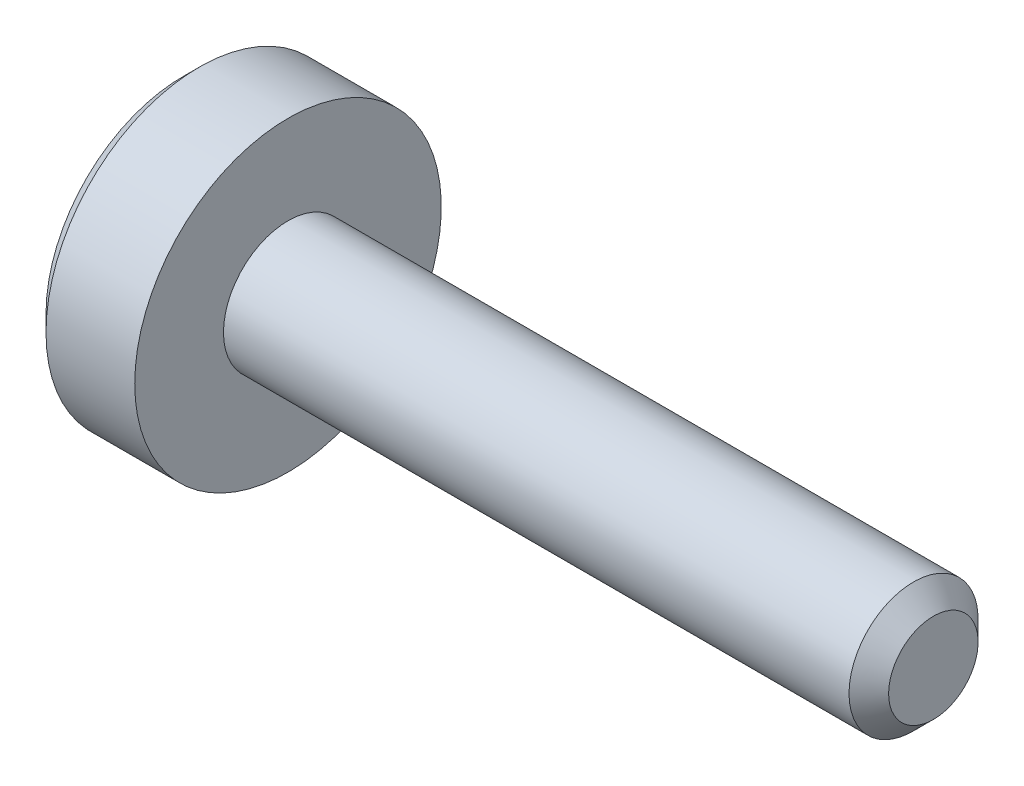
ISO-10303-21;
HEADER;
FILE_DESCRIPTION(('STEP AP214'),'2;1');
FILE_NAME('part.step','',(''),(''),'','','');
FILE_SCHEMA(('AUTOMOTIVE_DESIGN { 1 0 10303 214 1 1 1 1 }'));
ENDSEC;
DATA;
#1=APPLICATION_CONTEXT('core data for automotive mechanical design processes');
#2=APPLICATION_PROTOCOL_DEFINITION('international standard','automotive_design',2000,#1);
#3=PRODUCT_CONTEXT('',#1,'mechanical');
#4=PRODUCT('Part','Part','',(#3));
#5=PRODUCT_RELATED_PRODUCT_CATEGORY('part','',(#4));
#6=PRODUCT_DEFINITION_FORMATION('','',#4);
#7=PRODUCT_DEFINITION_CONTEXT('part definition',#1,'design');
#8=PRODUCT_DEFINITION('design','',#6,#7);
#9=PRODUCT_DEFINITION_SHAPE('','',#8);
#10=(LENGTH_UNIT() NAMED_UNIT(*) SI_UNIT(.MILLI.,.METRE.));
#11=(NAMED_UNIT(*) PLANE_ANGLE_UNIT() SI_UNIT($,.RADIAN.));
#12=(NAMED_UNIT(*) SI_UNIT($,.STERADIAN.) SOLID_ANGLE_UNIT());
#13=UNCERTAINTY_MEASURE_WITH_UNIT(LENGTH_MEASURE(1.E-05),#10,'distance_accuracy_value','');
#14=(GEOMETRIC_REPRESENTATION_CONTEXT(3) GLOBAL_UNCERTAINTY_ASSIGNED_CONTEXT((#13)) GLOBAL_UNIT_ASSIGNED_CONTEXT((#10,
#11,#12)) REPRESENTATION_CONTEXT('',''));
#15=CARTESIAN_POINT('',(0.,0.,0.));
#16=DIRECTION('',(0.,0.,1.));
#17=DIRECTION('',(1.,0.,0.));
#18=AXIS2_PLACEMENT_3D('',#15,#16,#17);
#19=CARTESIAN_POINT('',(-1.3,0.,0.));
#20=DIRECTION('',(1.,0.,0.));
#21=DIRECTION('',(0.,0.,-1.));
#22=AXIS2_PLACEMENT_3D('',#19,#20,#21);
#23=PLANE('',#22);
#24=CARTESIAN_POINT('',(-1.3,0.,0.));
#25=DIRECTION('',(-1.,0.,0.));
#26=DIRECTION('',(0.,0.,1.));
#27=AXIS2_PLACEMENT_3D('',#24,#25,#26);
#28=CIRCLE('',#27,1.7);
#29=CARTESIAN_POINT('',(-1.3,0.,1.7));
#30=VERTEX_POINT('',#29);
#31=EDGE_CURVE('E11',#30,#30,#28,.T.);
#32=ORIENTED_EDGE('',*,*,#31,.T.);
#33=EDGE_LOOP('',(#32));
#34=FACE_BOUND('',#33,.T.);
#35=DIRECTION('',(0.,-1.,0.));
#36=VECTOR('',#35,1.);
#37=CARTESIAN_POINT('',(-1.3,0.37527767497326,0.65));
#38=LINE('',#37,#36);
#39=CARTESIAN_POINT('',(-1.3,0.37527767497326,0.65));
#40=VERTEX_POINT('',#39);
#41=CARTESIAN_POINT('',(-1.3,-0.37527767497326,0.65));
#42=VERTEX_POINT('',#41);
#43=EDGE_CURVE('E55',#40,#42,#38,.T.);
#44=ORIENTED_EDGE('',*,*,#43,.T.);
#45=DIRECTION('',(0.,-0.499999999999993,-0.866025403784442));
#46=VECTOR('',#45,1.);
#47=CARTESIAN_POINT('',(-1.3,-0.37527767497326,0.65));
#48=LINE('',#47,#46);
#49=CARTESIAN_POINT('',(-1.3,-0.75055534994651,0.));
#50=VERTEX_POINT('',#49);
#51=EDGE_CURVE('E126',#42,#50,#48,.T.);
#52=ORIENTED_EDGE('',*,*,#51,.T.);
#53=DIRECTION('',(0.,0.499999999999993,-0.866025403784442));
#54=VECTOR('',#53,1.);
#55=CARTESIAN_POINT('',(-1.3,-0.75055534994651,0.));
#56=LINE('',#55,#54);
#57=CARTESIAN_POINT('',(-1.3,-0.37527767497326,-0.65));
#58=VERTEX_POINT('',#57);
#59=EDGE_CURVE('E129',#50,#58,#56,.T.);
#60=ORIENTED_EDGE('',*,*,#59,.T.);
#61=DIRECTION('',(0.,1.,0.));
#62=VECTOR('',#61,1.);
#63=CARTESIAN_POINT('',(-1.3,-0.37527767497326,-0.65));
#64=LINE('',#63,#62);
#65=CARTESIAN_POINT('',(-1.3,0.37527767497326,-0.65));
#66=VERTEX_POINT('',#65);
#67=EDGE_CURVE('E132',#58,#66,#64,.T.);
#68=ORIENTED_EDGE('',*,*,#67,.T.);
#69=DIRECTION('',(0.,0.499999999999993,0.866025403784442));
#70=VECTOR('',#69,1.);
#71=CARTESIAN_POINT('',(-1.3,0.37527767497326,-0.65));
#72=LINE('',#71,#70);
#73=CARTESIAN_POINT('',(-1.3,0.75055534994651,0.));
#74=VERTEX_POINT('',#73);
#75=EDGE_CURVE('E116',#66,#74,#72,.T.);
#76=ORIENTED_EDGE('',*,*,#75,.T.);
#77=DIRECTION('',(0.,-0.499999999999993,0.866025403784442));
#78=VECTOR('',#77,1.);
#79=CARTESIAN_POINT('',(-1.3,0.75055534994651,0.));
#80=LINE('',#79,#78);
#81=EDGE_CURVE('E135',#74,#40,#80,.T.);
#82=ORIENTED_EDGE('',*,*,#81,.T.);
#83=EDGE_LOOP('',(#44,#52,#60,#68,#76,#82));
#84=FACE_BOUND('',#83,.T.);
#85=ADVANCED_FACE('F41',(#34,#84),#23,.F.);
#86=CARTESIAN_POINT('',(-1.1,0.,0.));
#87=DIRECTION('',(1.,0.,0.));
#88=DIRECTION('',(0.,0.,-1.));
#89=AXIS2_PLACEMENT_3D('',#86,#87,#88);
#90=CONICAL_SURFACE('',#89,1.9,0.785398163397452);
#91=ORIENTED_EDGE('',*,*,#31,.F.);
#92=EDGE_LOOP('',(#91));
#93=FACE_BOUND('',#92,.T.);
#94=CARTESIAN_POINT('',(-1.1,0.,0.));
#95=DIRECTION('',(-1.,0.,0.));
#96=DIRECTION('',(0.,0.,1.));
#97=AXIS2_PLACEMENT_3D('',#94,#95,#96);
#98=CIRCLE('',#97,1.9);
#99=CARTESIAN_POINT('',(-1.1,0.,1.9));
#100=VERTEX_POINT('',#99);
#101=EDGE_CURVE('E48',#100,#100,#98,.T.);
#102=ORIENTED_EDGE('',*,*,#101,.T.);
#103=EDGE_LOOP('',(#102));
#104=FACE_BOUND('',#103,.T.);
#105=ADVANCED_FACE('F160',(#93,#104),#90,.T.);
#106=CARTESIAN_POINT('',(8.,0.,0.));
#107=DIRECTION('',(-1.,0.,0.));
#108=DIRECTION('',(0.,0.,1.));
#109=AXIS2_PLACEMENT_3D('',#106,#107,#108);
#110=CYLINDRICAL_SURFACE('',#109,1.9);
#111=ORIENTED_EDGE('',*,*,#101,.F.);
#112=EDGE_LOOP('',(#111));
#113=FACE_BOUND('',#112,.T.);
#114=CARTESIAN_POINT('',(0.,0.,0.));
#115=DIRECTION('',(-1.,0.,0.));
#116=DIRECTION('',(0.,0.,1.));
#117=AXIS2_PLACEMENT_3D('',#114,#115,#116);
#118=CIRCLE('',#117,1.9);
#119=CARTESIAN_POINT('',(0.,0.,1.9));
#120=VERTEX_POINT('',#119);
#121=EDGE_CURVE('E155',#120,#120,#118,.T.);
#122=ORIENTED_EDGE('',*,*,#121,.T.);
#123=EDGE_LOOP('',(#122));
#124=FACE_BOUND('',#123,.T.);
#125=ADVANCED_FACE('F162',(#113,#124),#110,.T.);
#126=CARTESIAN_POINT('',(0.,1.9,0.));
#127=DIRECTION('',(-1.,0.,0.));
#128=DIRECTION('',(0.,0.,1.));
#129=AXIS2_PLACEMENT_3D('',#126,#127,#128);
#130=PLANE('',#129);
#131=ORIENTED_EDGE('',*,*,#121,.F.);
#132=EDGE_LOOP('',(#131));
#133=FACE_BOUND('',#132,.T.);
#134=CARTESIAN_POINT('',(0.,0.,0.));
#135=DIRECTION('',(-1.,0.,0.));
#136=DIRECTION('',(0.,0.,1.));
#137=AXIS2_PLACEMENT_3D('',#134,#135,#136);
#138=CIRCLE('',#137,0.8);
#139=CARTESIAN_POINT('',(0.,0.,0.8));
#140=VERTEX_POINT('',#139);
#141=EDGE_CURVE('E152',#140,#140,#138,.T.);
#142=ORIENTED_EDGE('',*,*,#141,.T.);
#143=EDGE_LOOP('',(#142));
#144=FACE_BOUND('',#143,.T.);
#145=ADVANCED_FACE('F165',(#133,#144),#130,.F.);
#146=CARTESIAN_POINT('',(8.,0.,0.));
#147=DIRECTION('',(-1.,0.,0.));
#148=DIRECTION('',(0.,0.,1.));
#149=AXIS2_PLACEMENT_3D('',#146,#147,#148);
#150=CYLINDRICAL_SURFACE('',#149,0.800000000000001);
#151=ORIENTED_EDGE('',*,*,#141,.F.);
#152=EDGE_LOOP('',(#151));
#153=FACE_BOUND('',#152,.T.);
#154=CARTESIAN_POINT('',(7.7545,0.,0.));
#155=DIRECTION('',(-1.,0.,0.));
#156=DIRECTION('',(0.,0.,1.));
#157=AXIS2_PLACEMENT_3D('',#154,#155,#156);
#158=CIRCLE('',#157,0.800000000000001);
#159=CARTESIAN_POINT('',(7.7545,0.,0.800000000000001));
#160=VERTEX_POINT('',#159);
#161=EDGE_CURVE('E149',#160,#160,#158,.T.);
#162=ORIENTED_EDGE('',*,*,#161,.T.);
#163=EDGE_LOOP('',(#162));
#164=FACE_BOUND('',#163,.T.);
#165=ADVANCED_FACE('F171',(#153,#164),#150,.T.);
#166=CARTESIAN_POINT('',(8.,0.,0.));
#167=DIRECTION('',(-1.,0.,0.));
#168=DIRECTION('',(0.,0.,1.));
#169=AXIS2_PLACEMENT_3D('',#166,#167,#168);
#170=CONICAL_SURFACE('',#169,0.554500000000001,0.785398163397448);
#171=ORIENTED_EDGE('',*,*,#161,.F.);
#172=EDGE_LOOP('',(#171));
#173=FACE_BOUND('',#172,.T.);
#174=CARTESIAN_POINT('',(8.,0.,0.));
#175=DIRECTION('',(-1.,0.,0.));
#176=DIRECTION('',(0.,0.,1.));
#177=AXIS2_PLACEMENT_3D('',#174,#175,#176);
#178=CIRCLE('',#177,0.554500000000001);
#179=CARTESIAN_POINT('',(8.,0.,0.554500000000001));
#180=VERTEX_POINT('',#179);
#181=EDGE_CURVE('E146',#180,#180,#178,.T.);
#182=ORIENTED_EDGE('',*,*,#181,.T.);
#183=EDGE_LOOP('',(#182));
#184=FACE_BOUND('',#183,.T.);
#185=ADVANCED_FACE('F177',(#173,#184),#170,.T.);
#186=CARTESIAN_POINT('',(8.,0.554500000000001,0.));
#187=DIRECTION('',(-1.,0.,0.));
#188=DIRECTION('',(0.,0.,1.));
#189=AXIS2_PLACEMENT_3D('',#186,#187,#188);
#190=PLANE('',#189);
#191=ORIENTED_EDGE('',*,*,#181,.F.);
#192=EDGE_LOOP('',(#191));
#193=FACE_BOUND('',#192,.T.);
#194=ADVANCED_FACE('F183',(#193),#190,.F.);
#195=CARTESIAN_POINT('',(-0.6,0.37527767497326,0.65));
#196=DIRECTION('',(0.,0.,-1.));
#197=DIRECTION('',(-1.,0.,0.));
#198=AXIS2_PLACEMENT_3D('',#195,#196,#197);
#199=PLANE('',#198);
#200=ORIENTED_EDGE('',*,*,#43,.F.);
#201=DIRECTION('',(-1.,0.,0.));
#202=VECTOR('',#201,1.);
#203=CARTESIAN_POINT('',(-0.6,0.37527767497326,0.65));
#204=LINE('',#203,#202);
#205=CARTESIAN_POINT('',(-0.6,0.37527767497326,0.65));
#206=VERTEX_POINT('',#205);
#207=EDGE_CURVE('E121',#206,#40,#204,.T.);
#208=ORIENTED_EDGE('',*,*,#207,.F.);
#209=DIRECTION('',(0.,-1.,0.));
#210=VECTOR('',#209,1.);
#211=CARTESIAN_POINT('',(-0.6,0.37527767497326,0.65));
#212=LINE('',#211,#210);
#213=CARTESIAN_POINT('',(-0.6,-0.37527767497326,0.65));
#214=VERTEX_POINT('',#213);
#215=EDGE_CURVE('E138',#206,#214,#212,.T.);
#216=ORIENTED_EDGE('',*,*,#215,.T.);
#217=DIRECTION('',(-1.,0.,0.));
#218=VECTOR('',#217,1.);
#219=CARTESIAN_POINT('',(-0.6,-0.37527767497326,0.65));
#220=LINE('',#219,#218);
#221=EDGE_CURVE('E144',#214,#42,#220,.T.);
#222=ORIENTED_EDGE('',*,*,#221,.T.);
#223=EDGE_LOOP('',(#200,#208,#216,#222));
#224=FACE_BOUND('',#223,.T.);
#225=ADVANCED_FACE('F188',(#224),#199,.T.);
#226=CARTESIAN_POINT('',(-0.6,-0.37527767497326,0.65));
#227=DIRECTION('',(0.,0.866025403784442,-0.499999999999993));
#228=DIRECTION('',(0.,0.499999999999993,0.866025403784442));
#229=AXIS2_PLACEMENT_3D('',#226,#227,#228);
#230=PLANE('',#229);
#231=ORIENTED_EDGE('',*,*,#51,.F.);
#232=ORIENTED_EDGE('',*,*,#221,.F.);
#233=DIRECTION('',(0.,-0.499999999999993,-0.866025403784442));
#234=VECTOR('',#233,1.);
#235=CARTESIAN_POINT('',(-0.6,-0.37527767497326,0.65));
#236=LINE('',#235,#234);
#237=CARTESIAN_POINT('',(-0.6,-0.75055534994651,0.));
#238=VERTEX_POINT('',#237);
#239=EDGE_CURVE('E94',#214,#238,#236,.T.);
#240=ORIENTED_EDGE('',*,*,#239,.T.);
#241=DIRECTION('',(-1.,0.,0.));
#242=VECTOR('',#241,1.);
#243=CARTESIAN_POINT('',(-0.6,-0.75055534994651,0.));
#244=LINE('',#243,#242);
#245=EDGE_CURVE('E142',#238,#50,#244,.T.);
#246=ORIENTED_EDGE('',*,*,#245,.T.);
#247=EDGE_LOOP('',(#231,#232,#240,#246));
#248=FACE_BOUND('',#247,.T.);
#249=ADVANCED_FACE('F193',(#248),#230,.T.);
#250=CARTESIAN_POINT('',(-0.6,-0.75055534994651,0.));
#251=DIRECTION('',(0.,0.866025403784442,0.499999999999993));
#252=DIRECTION('',(0.,-0.499999999999993,0.866025403784442));
#253=AXIS2_PLACEMENT_3D('',#250,#251,#252);
#254=PLANE('',#253);
#255=ORIENTED_EDGE('',*,*,#59,.F.);
#256=ORIENTED_EDGE('',*,*,#245,.F.);
#257=DIRECTION('',(0.,0.499999999999993,-0.866025403784442));
#258=VECTOR('',#257,1.);
#259=CARTESIAN_POINT('',(-0.6,-0.75055534994651,0.));
#260=LINE('',#259,#258);
#261=CARTESIAN_POINT('',(-0.6,-0.37527767497326,-0.65));
#262=VERTEX_POINT('',#261);
#263=EDGE_CURVE('E112',#238,#262,#260,.T.);
#264=ORIENTED_EDGE('',*,*,#263,.T.);
#265=DIRECTION('',(-1.,0.,0.));
#266=VECTOR('',#265,1.);
#267=CARTESIAN_POINT('',(-0.6,-0.37527767497326,-0.65));
#268=LINE('',#267,#266);
#269=EDGE_CURVE('E109',#262,#58,#268,.T.);
#270=ORIENTED_EDGE('',*,*,#269,.T.);
#271=EDGE_LOOP('',(#255,#256,#264,#270));
#272=FACE_BOUND('',#271,.T.);
#273=ADVANCED_FACE('F210',(#272),#254,.T.);
#274=CARTESIAN_POINT('',(-0.6,-0.37527767497326,-0.65));
#275=DIRECTION('',(0.,0.,1.));
#276=DIRECTION('',(1.,0.,0.));
#277=AXIS2_PLACEMENT_3D('',#274,#275,#276);
#278=PLANE('',#277);
#279=ORIENTED_EDGE('',*,*,#67,.F.);
#280=ORIENTED_EDGE('',*,*,#269,.F.);
#281=DIRECTION('',(0.,1.,0.));
#282=VECTOR('',#281,1.);
#283=CARTESIAN_POINT('',(-0.6,-0.37527767497326,-0.65));
#284=LINE('',#283,#282);
#285=CARTESIAN_POINT('',(-0.6,0.37527767497326,-0.65));
#286=VERTEX_POINT('',#285);
#287=EDGE_CURVE('E104',#262,#286,#284,.T.);
#288=ORIENTED_EDGE('',*,*,#287,.T.);
#289=DIRECTION('',(-1.,0.,0.));
#290=VECTOR('',#289,1.);
#291=CARTESIAN_POINT('',(-0.6,0.37527767497326,-0.65));
#292=LINE('',#291,#290);
#293=EDGE_CURVE('E108',#286,#66,#292,.T.);
#294=ORIENTED_EDGE('',*,*,#293,.T.);
#295=EDGE_LOOP('',(#279,#280,#288,#294));
#296=FACE_BOUND('',#295,.T.);
#297=ADVANCED_FACE('F107',(#296),#278,.T.);
#298=CARTESIAN_POINT('',(-0.6,0.37527767497326,-0.65));
#299=DIRECTION('',(0.,-0.866025403784442,0.499999999999993));
#300=DIRECTION('',(0.,-0.499999999999993,-0.866025403784442));
#301=AXIS2_PLACEMENT_3D('',#298,#299,#300);
#302=PLANE('',#301);
#303=ORIENTED_EDGE('',*,*,#75,.F.);
#304=ORIENTED_EDGE('',*,*,#293,.F.);
#305=DIRECTION('',(0.,0.499999999999993,0.866025403784442));
#306=VECTOR('',#305,1.);
#307=CARTESIAN_POINT('',(-0.6,0.37527767497326,-0.65));
#308=LINE('',#307,#306);
#309=CARTESIAN_POINT('',(-0.6,0.75055534994651,0.));
#310=VERTEX_POINT('',#309);
#311=EDGE_CURVE('E111',#286,#310,#308,.T.);
#312=ORIENTED_EDGE('',*,*,#311,.T.);
#313=DIRECTION('',(-1.,0.,0.));
#314=VECTOR('',#313,1.);
#315=CARTESIAN_POINT('',(-0.6,0.75055534994651,0.));
#316=LINE('',#315,#314);
#317=EDGE_CURVE('E85',#310,#74,#316,.T.);
#318=ORIENTED_EDGE('',*,*,#317,.T.);
#319=EDGE_LOOP('',(#303,#304,#312,#318));
#320=FACE_BOUND('',#319,.T.);
#321=ADVANCED_FACE('F114',(#320),#302,.T.);
#322=CARTESIAN_POINT('',(-0.6,0.75055534994651,0.));
#323=DIRECTION('',(0.,-0.866025403784442,-0.499999999999993));
#324=DIRECTION('',(0.,0.499999999999993,-0.866025403784442));
#325=AXIS2_PLACEMENT_3D('',#322,#323,#324);
#326=PLANE('',#325);
#327=ORIENTED_EDGE('',*,*,#81,.F.);
#328=ORIENTED_EDGE('',*,*,#317,.F.);
#329=DIRECTION('',(0.,-0.499999999999993,0.866025403784442));
#330=VECTOR('',#329,1.);
#331=CARTESIAN_POINT('',(-0.6,0.75055534994651,0.));
#332=LINE('',#331,#330);
#333=EDGE_CURVE('E63',#310,#206,#332,.T.);
#334=ORIENTED_EDGE('',*,*,#333,.T.);
#335=ORIENTED_EDGE('',*,*,#207,.T.);
#336=EDGE_LOOP('',(#327,#328,#334,#335));
#337=FACE_BOUND('',#336,.T.);
#338=ADVANCED_FACE('F203',(#337),#326,.T.);
#339=CARTESIAN_POINT('',(-0.6,0.,0.));
#340=DIRECTION('',(1.,0.,0.));
#341=DIRECTION('',(0.,0.,-1.));
#342=AXIS2_PLACEMENT_3D('',#339,#340,#341);
#343=PLANE('',#342);
#344=ORIENTED_EDGE('',*,*,#215,.F.);
#345=ORIENTED_EDGE('',*,*,#333,.F.);
#346=ORIENTED_EDGE('',*,*,#311,.F.);
#347=ORIENTED_EDGE('',*,*,#287,.F.);
#348=ORIENTED_EDGE('',*,*,#263,.F.);
#349=ORIENTED_EDGE('',*,*,#239,.F.);
#350=EDGE_LOOP('',(#344,#345,#346,#347,#348,#349));
#351=FACE_BOUND('',#350,.T.);
#352=ADVANCED_FACE('F119',(#351),#343,.F.);
#353=CLOSED_SHELL('',(#85,#105,#125,#145,#165,#185,#194,#225,#249,#273,#297,#321,#338,#352));
#354=MANIFOLD_SOLID_BREP('B2',#353);
#355=ADVANCED_BREP_SHAPE_REPRESENTATION('',(#18,#354),#14);
#356=SHAPE_DEFINITION_REPRESENTATION(#9,#355);
ENDSEC;
END-ISO-10303-21;
